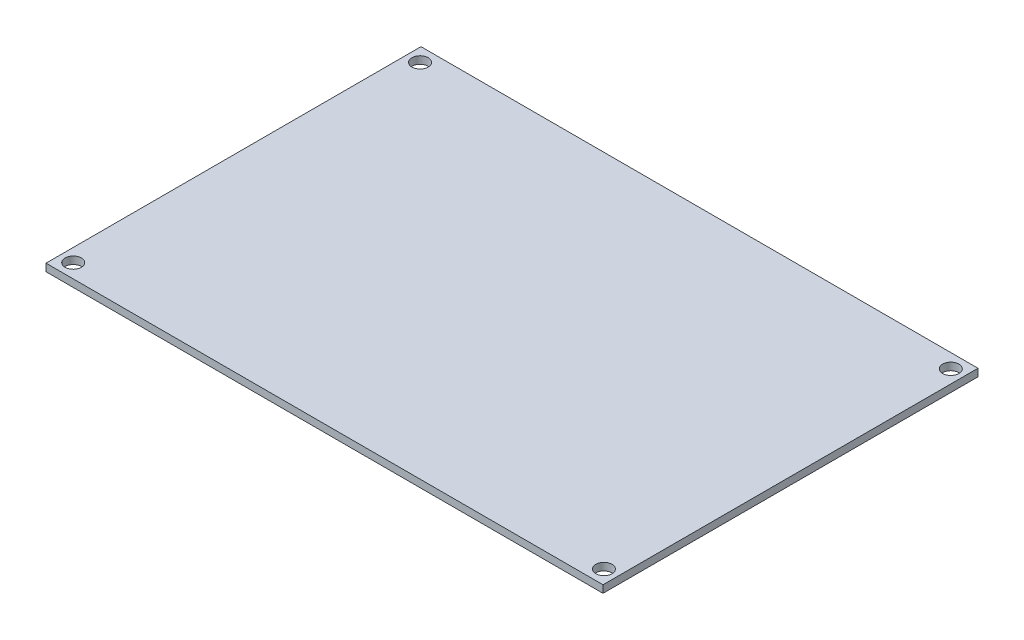
ISO-10303-21;
HEADER;
FILE_DESCRIPTION(('STEP AP214'),'2;1');
FILE_NAME('part.step','',(''),(''),'','','');
FILE_SCHEMA(('AUTOMOTIVE_DESIGN { 1 0 10303 214 1 1 1 1 }'));
ENDSEC;
DATA;
#1=APPLICATION_CONTEXT('core data for automotive mechanical design processes');
#2=APPLICATION_PROTOCOL_DEFINITION('international standard','automotive_design',2000,#1);
#3=PRODUCT_CONTEXT('',#1,'mechanical');
#4=PRODUCT('Part','Part','',(#3));
#5=PRODUCT_RELATED_PRODUCT_CATEGORY('part','',(#4));
#6=PRODUCT_DEFINITION_FORMATION('','',#4);
#7=PRODUCT_DEFINITION_CONTEXT('part definition',#1,'design');
#8=PRODUCT_DEFINITION('design','',#6,#7);
#9=PRODUCT_DEFINITION_SHAPE('','',#8);
#10=(LENGTH_UNIT() NAMED_UNIT(*) SI_UNIT(.MILLI.,.METRE.));
#11=(NAMED_UNIT(*) PLANE_ANGLE_UNIT() SI_UNIT($,.RADIAN.));
#12=(NAMED_UNIT(*) SI_UNIT($,.STERADIAN.) SOLID_ANGLE_UNIT());
#13=UNCERTAINTY_MEASURE_WITH_UNIT(LENGTH_MEASURE(1.E-05),#10,'distance_accuracy_value','');
#14=(GEOMETRIC_REPRESENTATION_CONTEXT(3) GLOBAL_UNCERTAINTY_ASSIGNED_CONTEXT((#13)) GLOBAL_UNIT_ASSIGNED_CONTEXT((#10,
#11,#12)) REPRESENTATION_CONTEXT('',''));
#15=CARTESIAN_POINT('',(0.,0.,0.));
#16=DIRECTION('',(0.,0.,1.));
#17=DIRECTION('',(1.,0.,0.));
#18=AXIS2_PLACEMENT_3D('',#15,#16,#17);
#19=CARTESIAN_POINT('',(0.,1.6,0.));
#20=DIRECTION('',(0.,1.,0.));
#21=DIRECTION('',(0.,0.,1.));
#22=AXIS2_PLACEMENT_3D('',#19,#20,#21);
#23=PLANE('',#22);
#24=CARTESIAN_POINT('',(57.,1.6,37.25));
#25=DIRECTION('',(0.,1.,0.));
#26=DIRECTION('',(0.,0.,1.));
#27=AXIS2_PLACEMENT_3D('',#24,#25,#26);
#28=CIRCLE('',#27,1.75);
#29=CARTESIAN_POINT('',(57.,1.6,39.));
#30=VERTEX_POINT('',#29);
#31=EDGE_CURVE('E122',#30,#30,#28,.T.);
#32=ORIENTED_EDGE('',*,*,#31,.F.);
#33=EDGE_LOOP('',(#32));
#34=FACE_BOUND('',#33,.T.);
#35=CARTESIAN_POINT('',(-57.,1.6,-37.25));
#36=DIRECTION('',(0.,1.,0.));
#37=DIRECTION('',(0.,0.,1.));
#38=AXIS2_PLACEMENT_3D('',#35,#36,#37);
#39=CIRCLE('',#38,1.75);
#40=CARTESIAN_POINT('',(-57.,1.6,-35.5));
#41=VERTEX_POINT('',#40);
#42=EDGE_CURVE('E101',#41,#41,#39,.T.);
#43=ORIENTED_EDGE('',*,*,#42,.F.);
#44=EDGE_LOOP('',(#43));
#45=FACE_BOUND('',#44,.T.);
#46=DIRECTION('',(0.,0.,-1.));
#47=VECTOR('',#46,1.);
#48=CARTESIAN_POINT('',(59.825,1.6,-40.275));
#49=LINE('',#48,#47);
#50=CARTESIAN_POINT('',(59.825,1.6,40.275));
#51=VERTEX_POINT('',#50);
#52=CARTESIAN_POINT('',(59.825,1.6,-40.275));
#53=VERTEX_POINT('',#52);
#54=EDGE_CURVE('E86',#51,#53,#49,.T.);
#55=ORIENTED_EDGE('',*,*,#54,.T.);
#56=DIRECTION('',(-1.,0.,0.));
#57=VECTOR('',#56,1.);
#58=CARTESIAN_POINT('',(-59.825,1.6,-40.275));
#59=LINE('',#58,#57);
#60=CARTESIAN_POINT('',(-59.825,1.6,-40.275));
#61=VERTEX_POINT('',#60);
#62=EDGE_CURVE('E81',#53,#61,#59,.T.);
#63=ORIENTED_EDGE('',*,*,#62,.T.);
#64=DIRECTION('',(0.,0.,1.));
#65=VECTOR('',#64,1.);
#66=CARTESIAN_POINT('',(-59.825,1.6,-40.275));
#67=LINE('',#66,#65);
#68=CARTESIAN_POINT('',(-59.825,1.6,40.275));
#69=VERTEX_POINT('',#68);
#70=EDGE_CURVE('E84',#61,#69,#67,.T.);
#71=ORIENTED_EDGE('',*,*,#70,.T.);
#72=DIRECTION('',(1.,0.,0.));
#73=VECTOR('',#72,1.);
#74=CARTESIAN_POINT('',(-59.825,1.6,40.275));
#75=LINE('',#74,#73);
#76=EDGE_CURVE('E51',#69,#51,#75,.T.);
#77=ORIENTED_EDGE('',*,*,#76,.T.);
#78=EDGE_LOOP('',(#55,#63,#71,#77));
#79=FACE_BOUND('',#78,.T.);
#80=CARTESIAN_POINT('',(57.,1.6,-37.25));
#81=DIRECTION('',(0.,1.,0.));
#82=DIRECTION('',(0.,0.,-1.));
#83=AXIS2_PLACEMENT_3D('',#80,#81,#82);
#84=CIRCLE('',#83,1.75);
#85=CARTESIAN_POINT('',(57.,1.6,-39.));
#86=VERTEX_POINT('',#85);
#87=EDGE_CURVE('E116',#86,#86,#84,.T.);
#88=ORIENTED_EDGE('',*,*,#87,.F.);
#89=EDGE_LOOP('',(#88));
#90=FACE_BOUND('',#89,.T.);
#91=CARTESIAN_POINT('',(-57.,1.6,37.25));
#92=DIRECTION('',(0.,1.,0.));
#93=DIRECTION('',(0.,0.,-1.));
#94=AXIS2_PLACEMENT_3D('',#91,#92,#93);
#95=CIRCLE('',#94,1.75);
#96=CARTESIAN_POINT('',(-57.,1.6,35.5));
#97=VERTEX_POINT('',#96);
#98=EDGE_CURVE('E128',#97,#97,#95,.T.);
#99=ORIENTED_EDGE('',*,*,#98,.F.);
#100=EDGE_LOOP('',(#99));
#101=FACE_BOUND('',#100,.T.);
#102=ADVANCED_FACE('F34',(#34,#45,#79,#90,#101),#23,.T.);
#103=CARTESIAN_POINT('',(0.,0.,0.));
#104=DIRECTION('',(0.,1.,0.));
#105=DIRECTION('',(0.,0.,1.));
#106=AXIS2_PLACEMENT_3D('',#103,#104,#105);
#107=PLANE('',#106);
#108=DIRECTION('',(0.,0.,-1.));
#109=VECTOR('',#108,1.);
#110=CARTESIAN_POINT('',(59.825,0.,-40.275));
#111=LINE('',#110,#109);
#112=CARTESIAN_POINT('',(59.825,0.,40.275));
#113=VERTEX_POINT('',#112);
#114=CARTESIAN_POINT('',(59.825,0.,-40.275));
#115=VERTEX_POINT('',#114);
#116=EDGE_CURVE('E98',#113,#115,#111,.T.);
#117=ORIENTED_EDGE('',*,*,#116,.F.);
#118=DIRECTION('',(1.,0.,0.));
#119=VECTOR('',#118,1.);
#120=CARTESIAN_POINT('',(-59.825,0.,40.275));
#121=LINE('',#120,#119);
#122=CARTESIAN_POINT('',(-59.825,0.,40.275));
#123=VERTEX_POINT('',#122);
#124=EDGE_CURVE('E74',#123,#113,#121,.T.);
#125=ORIENTED_EDGE('',*,*,#124,.F.);
#126=DIRECTION('',(0.,0.,1.));
#127=VECTOR('',#126,1.);
#128=CARTESIAN_POINT('',(-59.825,0.,-40.275));
#129=LINE('',#128,#127);
#130=CARTESIAN_POINT('',(-59.825,0.,-40.275));
#131=VERTEX_POINT('',#130);
#132=EDGE_CURVE('E68',#131,#123,#129,.T.);
#133=ORIENTED_EDGE('',*,*,#132,.F.);
#134=DIRECTION('',(-1.,0.,0.));
#135=VECTOR('',#134,1.);
#136=CARTESIAN_POINT('',(-59.825,0.,-40.275));
#137=LINE('',#136,#135);
#138=EDGE_CURVE('E90',#115,#131,#137,.T.);
#139=ORIENTED_EDGE('',*,*,#138,.F.);
#140=EDGE_LOOP('',(#117,#125,#133,#139));
#141=FACE_BOUND('',#140,.T.);
#142=CARTESIAN_POINT('',(-57.,0.,-37.25));
#143=DIRECTION('',(0.,1.,0.));
#144=DIRECTION('',(0.,0.,1.));
#145=AXIS2_PLACEMENT_3D('',#142,#143,#144);
#146=CIRCLE('',#145,1.75);
#147=CARTESIAN_POINT('',(-57.,0.,-35.5));
#148=VERTEX_POINT('',#147);
#149=EDGE_CURVE('E113',#148,#148,#146,.T.);
#150=ORIENTED_EDGE('',*,*,#149,.T.);
#151=EDGE_LOOP('',(#150));
#152=FACE_BOUND('',#151,.T.);
#153=CARTESIAN_POINT('',(57.,0.,-37.25));
#154=DIRECTION('',(0.,1.,0.));
#155=DIRECTION('',(0.,0.,-1.));
#156=AXIS2_PLACEMENT_3D('',#153,#154,#155);
#157=CIRCLE('',#156,1.75);
#158=CARTESIAN_POINT('',(57.,0.,-39.));
#159=VERTEX_POINT('',#158);
#160=EDGE_CURVE('E119',#159,#159,#157,.T.);
#161=ORIENTED_EDGE('',*,*,#160,.T.);
#162=EDGE_LOOP('',(#161));
#163=FACE_BOUND('',#162,.T.);
#164=CARTESIAN_POINT('',(57.,0.,37.25));
#165=DIRECTION('',(0.,1.,0.));
#166=DIRECTION('',(0.,0.,1.));
#167=AXIS2_PLACEMENT_3D('',#164,#165,#166);
#168=CIRCLE('',#167,1.75);
#169=CARTESIAN_POINT('',(57.,0.,39.));
#170=VERTEX_POINT('',#169);
#171=EDGE_CURVE('E125',#170,#170,#168,.T.);
#172=ORIENTED_EDGE('',*,*,#171,.T.);
#173=EDGE_LOOP('',(#172));
#174=FACE_BOUND('',#173,.T.);
#175=CARTESIAN_POINT('',(-57.,0.,37.25));
#176=DIRECTION('',(0.,1.,0.));
#177=DIRECTION('',(0.,0.,-1.));
#178=AXIS2_PLACEMENT_3D('',#175,#176,#177);
#179=CIRCLE('',#178,1.75);
#180=CARTESIAN_POINT('',(-57.,0.,35.5));
#181=VERTEX_POINT('',#180);
#182=EDGE_CURVE('E131',#181,#181,#179,.T.);
#183=ORIENTED_EDGE('',*,*,#182,.T.);
#184=EDGE_LOOP('',(#183));
#185=FACE_BOUND('',#184,.T.);
#186=ADVANCED_FACE('F109',(#141,#152,#163,#174,#185),#107,.F.);
#187=CARTESIAN_POINT('',(59.825,1.6,-40.275));
#188=DIRECTION('',(-1.,0.,0.));
#189=DIRECTION('',(0.,0.,1.));
#190=AXIS2_PLACEMENT_3D('',#187,#188,#189);
#191=PLANE('',#190);
#192=ORIENTED_EDGE('',*,*,#116,.T.);
#193=DIRECTION('',(0.,-1.,0.));
#194=VECTOR('',#193,1.);
#195=CARTESIAN_POINT('',(59.825,1.6,-40.275));
#196=LINE('',#195,#194);
#197=EDGE_CURVE('E11',#53,#115,#196,.T.);
#198=ORIENTED_EDGE('',*,*,#197,.F.);
#199=ORIENTED_EDGE('',*,*,#54,.F.);
#200=DIRECTION('',(0.,-1.,0.));
#201=VECTOR('',#200,1.);
#202=CARTESIAN_POINT('',(59.825,1.6,40.275));
#203=LINE('',#202,#201);
#204=EDGE_CURVE('E94',#51,#113,#203,.T.);
#205=ORIENTED_EDGE('',*,*,#204,.T.);
#206=EDGE_LOOP('',(#192,#198,#199,#205));
#207=FACE_BOUND('',#206,.T.);
#208=ADVANCED_FACE('F36',(#207),#191,.F.);
#209=CARTESIAN_POINT('',(-59.825,1.6,-40.275));
#210=DIRECTION('',(0.,0.,1.));
#211=DIRECTION('',(1.,0.,0.));
#212=AXIS2_PLACEMENT_3D('',#209,#210,#211);
#213=PLANE('',#212);
#214=ORIENTED_EDGE('',*,*,#138,.T.);
#215=DIRECTION('',(0.,-1.,0.));
#216=VECTOR('',#215,1.);
#217=CARTESIAN_POINT('',(-59.825,1.6,-40.275));
#218=LINE('',#217,#216);
#219=EDGE_CURVE('E43',#61,#131,#218,.T.);
#220=ORIENTED_EDGE('',*,*,#219,.F.);
#221=ORIENTED_EDGE('',*,*,#62,.F.);
#222=ORIENTED_EDGE('',*,*,#197,.T.);
#223=EDGE_LOOP('',(#214,#220,#221,#222));
#224=FACE_BOUND('',#223,.T.);
#225=ADVANCED_FACE('F89',(#224),#213,.F.);
#226=CARTESIAN_POINT('',(-59.825,1.6,-40.275));
#227=DIRECTION('',(1.,0.,0.));
#228=DIRECTION('',(0.,0.,-1.));
#229=AXIS2_PLACEMENT_3D('',#226,#227,#228);
#230=PLANE('',#229);
#231=ORIENTED_EDGE('',*,*,#132,.T.);
#232=DIRECTION('',(0.,-1.,0.));
#233=VECTOR('',#232,1.);
#234=CARTESIAN_POINT('',(-59.825,1.6,40.275));
#235=LINE('',#234,#233);
#236=EDGE_CURVE('E91',#69,#123,#235,.T.);
#237=ORIENTED_EDGE('',*,*,#236,.F.);
#238=ORIENTED_EDGE('',*,*,#70,.F.);
#239=ORIENTED_EDGE('',*,*,#219,.T.);
#240=EDGE_LOOP('',(#231,#237,#238,#239));
#241=FACE_BOUND('',#240,.T.);
#242=ADVANCED_FACE('F92',(#241),#230,.F.);
#243=CARTESIAN_POINT('',(-59.825,1.6,40.275));
#244=DIRECTION('',(0.,0.,-1.));
#245=DIRECTION('',(-1.,0.,0.));
#246=AXIS2_PLACEMENT_3D('',#243,#244,#245);
#247=PLANE('',#246);
#248=ORIENTED_EDGE('',*,*,#124,.T.);
#249=ORIENTED_EDGE('',*,*,#204,.F.);
#250=ORIENTED_EDGE('',*,*,#76,.F.);
#251=ORIENTED_EDGE('',*,*,#236,.T.);
#252=EDGE_LOOP('',(#248,#249,#250,#251));
#253=FACE_BOUND('',#252,.T.);
#254=ADVANCED_FACE('F106',(#253),#247,.F.);
#255=CARTESIAN_POINT('',(-57.,1.6,-37.25));
#256=DIRECTION('',(0.,-1.,0.));
#257=DIRECTION('',(0.,0.,-1.));
#258=AXIS2_PLACEMENT_3D('',#255,#256,#257);
#259=CYLINDRICAL_SURFACE('',#258,1.75);
#260=ORIENTED_EDGE('',*,*,#42,.T.);
#261=EDGE_LOOP('',(#260));
#262=FACE_BOUND('',#261,.T.);
#263=ORIENTED_EDGE('',*,*,#149,.F.);
#264=EDGE_LOOP('',(#263));
#265=FACE_BOUND('',#264,.T.);
#266=ADVANCED_FACE('F150',(#262,#265),#259,.F.);
#267=CARTESIAN_POINT('',(57.,1.6,-37.25));
#268=DIRECTION('',(0.,-1.,0.));
#269=DIRECTION('',(0.,0.,-1.));
#270=AXIS2_PLACEMENT_3D('',#267,#268,#269);
#271=CYLINDRICAL_SURFACE('',#270,1.75);
#272=ORIENTED_EDGE('',*,*,#87,.T.);
#273=EDGE_LOOP('',(#272));
#274=FACE_BOUND('',#273,.T.);
#275=ORIENTED_EDGE('',*,*,#160,.F.);
#276=EDGE_LOOP('',(#275));
#277=FACE_BOUND('',#276,.T.);
#278=ADVANCED_FACE('F200',(#274,#277),#271,.F.);
#279=CARTESIAN_POINT('',(57.,1.6,37.25));
#280=DIRECTION('',(0.,-1.,0.));
#281=DIRECTION('',(0.,0.,-1.));
#282=AXIS2_PLACEMENT_3D('',#279,#280,#281);
#283=CYLINDRICAL_SURFACE('',#282,1.75);
#284=ORIENTED_EDGE('',*,*,#31,.T.);
#285=EDGE_LOOP('',(#284));
#286=FACE_BOUND('',#285,.T.);
#287=ORIENTED_EDGE('',*,*,#171,.F.);
#288=EDGE_LOOP('',(#287));
#289=FACE_BOUND('',#288,.T.);
#290=ADVANCED_FACE('F208',(#286,#289),#283,.F.);
#291=CARTESIAN_POINT('',(-57.,1.6,37.25));
#292=DIRECTION('',(0.,-1.,0.));
#293=DIRECTION('',(0.,0.,-1.));
#294=AXIS2_PLACEMENT_3D('',#291,#292,#293);
#295=CYLINDRICAL_SURFACE('',#294,1.75);
#296=ORIENTED_EDGE('',*,*,#98,.T.);
#297=EDGE_LOOP('',(#296));
#298=FACE_BOUND('',#297,.T.);
#299=ORIENTED_EDGE('',*,*,#182,.F.);
#300=EDGE_LOOP('',(#299));
#301=FACE_BOUND('',#300,.T.);
#302=ADVANCED_FACE('F137',(#298,#301),#295,.F.);
#303=CLOSED_SHELL('',(#102,#186,#208,#225,#242,#254,#266,#278,#290,#302));
#304=MANIFOLD_SOLID_BREP('B2',#303);
#305=ADVANCED_BREP_SHAPE_REPRESENTATION('',(#18,#304),#14);
#306=SHAPE_DEFINITION_REPRESENTATION(#9,#305);
ENDSEC;
END-ISO-10303-21;
